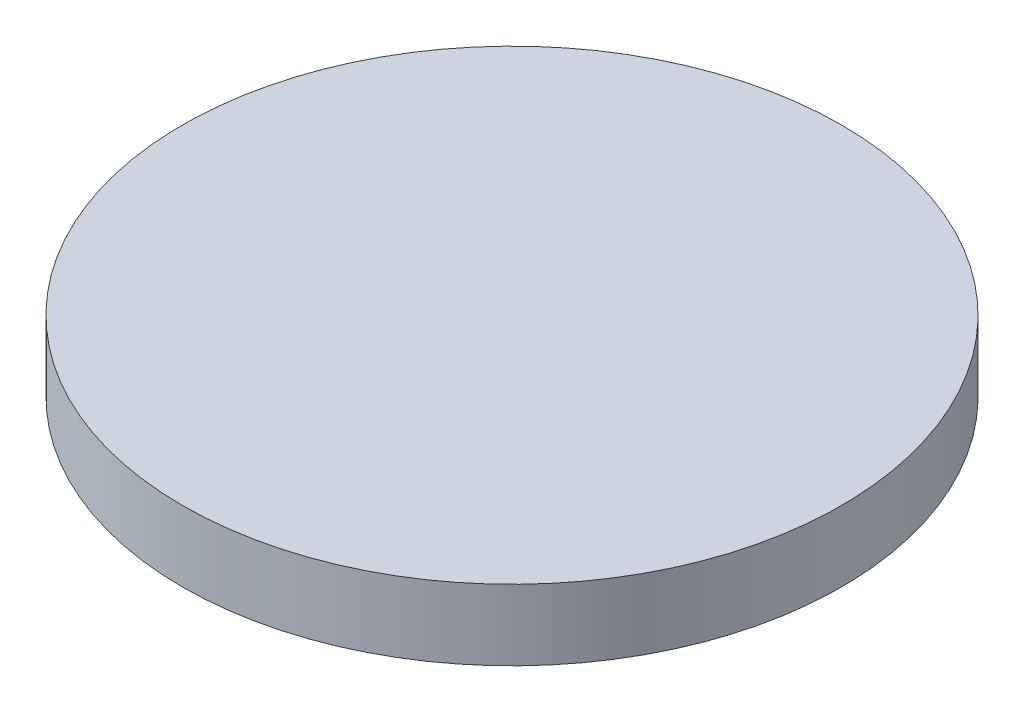
ISO-10303-21;
HEADER;
FILE_DESCRIPTION(('STEP AP214'),'2;1');
FILE_NAME('part.step','',(''),(''),'','','');
FILE_SCHEMA(('AUTOMOTIVE_DESIGN { 1 0 10303 214 1 1 1 1 }'));
ENDSEC;
DATA;
#1=APPLICATION_CONTEXT('core data for automotive mechanical design processes');
#2=APPLICATION_PROTOCOL_DEFINITION('international standard','automotive_design',2000,#1);
#3=PRODUCT_CONTEXT('',#1,'mechanical');
#4=PRODUCT('Part','Part','',(#3));
#5=PRODUCT_RELATED_PRODUCT_CATEGORY('part','',(#4));
#6=PRODUCT_DEFINITION_FORMATION('','',#4);
#7=PRODUCT_DEFINITION_CONTEXT('part definition',#1,'design');
#8=PRODUCT_DEFINITION('design','',#6,#7);
#9=PRODUCT_DEFINITION_SHAPE('','',#8);
#10=(LENGTH_UNIT() NAMED_UNIT(*) SI_UNIT(.MILLI.,.METRE.));
#11=(NAMED_UNIT(*) PLANE_ANGLE_UNIT() SI_UNIT($,.RADIAN.));
#12=(NAMED_UNIT(*) SI_UNIT($,.STERADIAN.) SOLID_ANGLE_UNIT());
#13=UNCERTAINTY_MEASURE_WITH_UNIT(LENGTH_MEASURE(1.E-05),#10,'distance_accuracy_value','');
#14=(GEOMETRIC_REPRESENTATION_CONTEXT(3) GLOBAL_UNCERTAINTY_ASSIGNED_CONTEXT((#13)) GLOBAL_UNIT_ASSIGNED_CONTEXT((#10,
#11,#12)) REPRESENTATION_CONTEXT('',''));
#15=CARTESIAN_POINT('',(0.,0.,0.));
#16=DIRECTION('',(0.,0.,1.));
#17=DIRECTION('',(1.,0.,0.));
#18=AXIS2_PLACEMENT_3D('',#15,#16,#17);
#19=CARTESIAN_POINT('',(0.,4.7625,0.));
#20=DIRECTION('',(0.,-1.,0.));
#21=DIRECTION('',(0.,0.,-1.));
#22=AXIS2_PLACEMENT_3D('',#19,#20,#21);
#23=CYLINDRICAL_SURFACE('',#22,44.45);
#24=CARTESIAN_POINT('',(0.,4.7625,0.));
#25=DIRECTION('',(0.,1.,0.));
#26=DIRECTION('',(0.,0.,1.));
#27=AXIS2_PLACEMENT_3D('',#24,#25,#26);
#28=CIRCLE('',#27,44.45);
#29=CARTESIAN_POINT('',(0.,4.7625,44.45));
#30=VERTEX_POINT('',#29);
#31=EDGE_CURVE('E10',#30,#30,#28,.T.);
#32=ORIENTED_EDGE('',*,*,#31,.F.);
#33=EDGE_LOOP('',(#32));
#34=FACE_BOUND('',#33,.T.);
#35=CARTESIAN_POINT('',(0.,-4.7625,0.));
#36=DIRECTION('',(0.,1.,0.));
#37=DIRECTION('',(0.,0.,1.));
#38=AXIS2_PLACEMENT_3D('',#35,#36,#37);
#39=CIRCLE('',#38,44.45);
#40=CARTESIAN_POINT('',(0.,-4.7625,44.45));
#41=VERTEX_POINT('',#40);
#42=EDGE_CURVE('E40',#41,#41,#39,.T.);
#43=ORIENTED_EDGE('',*,*,#42,.T.);
#44=EDGE_LOOP('',(#43));
#45=FACE_BOUND('',#44,.T.);
#46=ADVANCED_FACE('F37',(#34,#45),#23,.T.);
#47=CARTESIAN_POINT('',(0.,4.7625,0.));
#48=DIRECTION('',(0.,1.,0.));
#49=DIRECTION('',(0.,0.,1.));
#50=AXIS2_PLACEMENT_3D('',#47,#48,#49);
#51=PLANE('',#50);
#52=ORIENTED_EDGE('',*,*,#31,.T.);
#53=EDGE_LOOP('',(#52));
#54=FACE_BOUND('',#53,.T.);
#55=ADVANCED_FACE('F54',(#54),#51,.T.);
#56=CARTESIAN_POINT('',(0.,-4.7625,0.));
#57=DIRECTION('',(0.,1.,0.));
#58=DIRECTION('',(0.,0.,1.));
#59=AXIS2_PLACEMENT_3D('',#56,#57,#58);
#60=PLANE('',#59);
#61=ORIENTED_EDGE('',*,*,#42,.F.);
#62=EDGE_LOOP('',(#61));
#63=FACE_BOUND('',#62,.T.);
#64=ADVANCED_FACE('F52',(#63),#60,.F.);
#65=CLOSED_SHELL('',(#46,#55,#64));
#66=MANIFOLD_SOLID_BREP('B2',#65);
#67=ADVANCED_BREP_SHAPE_REPRESENTATION('',(#18,#66),#14);
#68=SHAPE_DEFINITION_REPRESENTATION(#9,#67);
ENDSEC;
END-ISO-10303-21;
